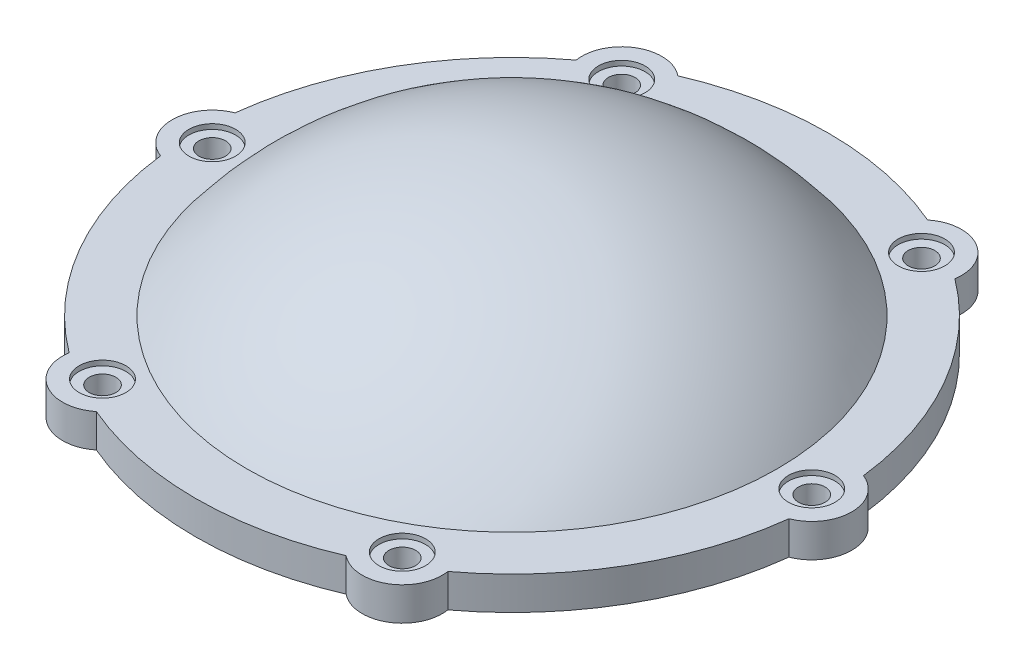
ISO-10303-21;
HEADER;
FILE_DESCRIPTION(('STEP AP214'),'2;1');
FILE_NAME('part.step','',(''),(''),'','','');
FILE_SCHEMA(('AUTOMOTIVE_DESIGN { 1 0 10303 214 1 1 1 1 }'));
ENDSEC;
DATA;
#1=APPLICATION_CONTEXT('core data for automotive mechanical design processes');
#2=APPLICATION_PROTOCOL_DEFINITION('international standard','automotive_design',2000,#1);
#3=PRODUCT_CONTEXT('',#1,'mechanical');
#4=PRODUCT('Part','Part','',(#3));
#5=PRODUCT_RELATED_PRODUCT_CATEGORY('part','',(#4));
#6=PRODUCT_DEFINITION_FORMATION('','',#4);
#7=PRODUCT_DEFINITION_CONTEXT('part definition',#1,'design');
#8=PRODUCT_DEFINITION('design','',#6,#7);
#9=PRODUCT_DEFINITION_SHAPE('','',#8);
#10=(LENGTH_UNIT() NAMED_UNIT(*) SI_UNIT(.MILLI.,.METRE.));
#11=(NAMED_UNIT(*) PLANE_ANGLE_UNIT() SI_UNIT($,.RADIAN.));
#12=(NAMED_UNIT(*) SI_UNIT($,.STERADIAN.) SOLID_ANGLE_UNIT());
#13=UNCERTAINTY_MEASURE_WITH_UNIT(LENGTH_MEASURE(1.E-05),#10,'distance_accuracy_value','');
#14=(GEOMETRIC_REPRESENTATION_CONTEXT(3) GLOBAL_UNCERTAINTY_ASSIGNED_CONTEXT((#13)) GLOBAL_UNIT_ASSIGNED_CONTEXT((#10,
#11,#12)) REPRESENTATION_CONTEXT('',''));
#15=CARTESIAN_POINT('',(0.,0.,0.));
#16=DIRECTION('',(0.,0.,1.));
#17=DIRECTION('',(1.,0.,0.));
#18=AXIS2_PLACEMENT_3D('',#15,#16,#17);
#19=CARTESIAN_POINT('',(0.,0.,0.));
#20=DIRECTION('',(0.,-1.,0.));
#21=DIRECTION('',(0.,0.,-1.));
#22=AXIS2_PLACEMENT_3D('',#19,#20,#21);
#23=CYLINDRICAL_SURFACE('',#22,47.5);
#24=DIRECTION('',(0.,1.,0.));
#25=VECTOR('',#24,1.);
#26=CARTESIAN_POINT('',(28.4293205648979,4.,-38.0529070140281));
#27=LINE('',#26,#25);
#28=CARTESIAN_POINT('',(28.4293205648979,6.5,-38.0529070140281));
#29=VERTEX_POINT('',#28);
#30=CARTESIAN_POINT('',(28.4293205648979,1.5,-38.0529070140281));
#31=VERTEX_POINT('',#30);
#32=EDGE_CURVE('E47',#29,#31,#27,.F.);
#33=ORIENTED_EDGE('',*,*,#32,.F.);
#34=CARTESIAN_POINT('',(0.,6.5,0.));
#35=DIRECTION('',(0.,-1.,0.));
#36=DIRECTION('',(0.,0.,-1.));
#37=AXIS2_PLACEMENT_3D('',#34,#35,#36);
#38=CIRCLE('',#37,47.5);
#39=CARTESIAN_POINT('',(47.1694444444444,6.5,-5.59406031451835));
#40=VERTEX_POINT('',#39);
#41=EDGE_CURVE('E130',#29,#40,#38,.T.);
#42=ORIENTED_EDGE('',*,*,#41,.T.);
#43=DIRECTION('',(0.,1.,0.));
#44=VECTOR('',#43,1.);
#45=CARTESIAN_POINT('',(47.1694444444444,4.,-5.59406031451835));
#46=LINE('',#45,#44);
#47=CARTESIAN_POINT('',(47.1694444444445,1.5,-5.59406031451836));
#48=VERTEX_POINT('',#47);
#49=EDGE_CURVE('E201',#48,#40,#46,.T.);
#50=ORIENTED_EDGE('',*,*,#49,.F.);
#51=CARTESIAN_POINT('',(0.,1.5,0.));
#52=DIRECTION('',(0.,-1.,0.));
#53=DIRECTION('',(0.,0.,-1.));
#54=AXIS2_PLACEMENT_3D('',#51,#52,#53);
#55=CIRCLE('',#54,47.5);
#56=EDGE_CURVE('E52',#31,#48,#55,.T.);
#57=ORIENTED_EDGE('',*,*,#56,.F.);
#58=EDGE_LOOP('',(#33,#42,#50,#57));
#59=FACE_BOUND('',#58,.T.);
#60=ADVANCED_FACE('F32',(#59),#23,.T.);
#61=DIRECTION('',(0.,1.,0.));
#62=VECTOR('',#61,1.);
#63=CARTESIAN_POINT('',(18.7401238795475,4.,-43.6469673285466));
#64=LINE('',#63,#62);
#65=CARTESIAN_POINT('',(18.7401238795475,1.5,-43.6469673285466));
#66=VERTEX_POINT('',#65);
#67=CARTESIAN_POINT('',(18.7401238795475,6.5,-43.6469673285466));
#68=VERTEX_POINT('',#67);
#69=EDGE_CURVE('E121',#66,#68,#64,.T.);
#70=ORIENTED_EDGE('',*,*,#69,.F.);
#71=CARTESIAN_POINT('',(-18.7401238795465,1.5,-43.646967328547));
#72=VERTEX_POINT('',#71);
#73=EDGE_CURVE('E240',#72,#66,#55,.T.);
#74=ORIENTED_EDGE('',*,*,#73,.F.);
#75=DIRECTION('',(0.,1.,0.));
#76=VECTOR('',#75,1.);
#77=CARTESIAN_POINT('',(-18.7401238795465,4.,-43.646967328547));
#78=LINE('',#77,#76);
#79=CARTESIAN_POINT('',(-18.7401238795465,6.5,-43.646967328547));
#80=VERTEX_POINT('',#79);
#81=EDGE_CURVE('E124',#80,#72,#78,.F.);
#82=ORIENTED_EDGE('',*,*,#81,.F.);
#83=EDGE_CURVE('E118',#80,#68,#38,.T.);
#84=ORIENTED_EDGE('',*,*,#83,.T.);
#85=EDGE_LOOP('',(#70,#74,#82,#84));
#86=FACE_BOUND('',#85,.T.);
#87=ADVANCED_FACE('F120',(#86),#23,.T.);
#88=DIRECTION('',(0.,1.,0.));
#89=VECTOR('',#88,1.);
#90=CARTESIAN_POINT('',(-28.4293205648971,4.,-38.0529070140287));
#91=LINE('',#90,#89);
#92=CARTESIAN_POINT('',(-28.4293205648971,1.5,-38.0529070140287));
#93=VERTEX_POINT('',#92);
#94=CARTESIAN_POINT('',(-28.4293205648971,6.5,-38.0529070140287));
#95=VERTEX_POINT('',#94);
#96=EDGE_CURVE('E156',#93,#95,#91,.T.);
#97=ORIENTED_EDGE('',*,*,#96,.F.);
#98=CARTESIAN_POINT('',(-47.1694444444444,1.5,-5.59406031451869));
#99=VERTEX_POINT('',#98);
#100=EDGE_CURVE('E241',#99,#93,#55,.T.);
#101=ORIENTED_EDGE('',*,*,#100,.F.);
#102=DIRECTION('',(0.,1.,0.));
#103=VECTOR('',#102,1.);
#104=CARTESIAN_POINT('',(-47.1694444444444,4.,-5.59406031451868));
#105=LINE('',#104,#103);
#106=CARTESIAN_POINT('',(-47.1694444444444,6.5,-5.59406031451869));
#107=VERTEX_POINT('',#106);
#108=EDGE_CURVE('E169',#107,#99,#105,.F.);
#109=ORIENTED_EDGE('',*,*,#108,.F.);
#110=EDGE_CURVE('E129',#107,#95,#38,.T.);
#111=ORIENTED_EDGE('',*,*,#110,.T.);
#112=EDGE_LOOP('',(#97,#101,#109,#111));
#113=FACE_BOUND('',#112,.T.);
#114=ADVANCED_FACE('F258',(#113),#23,.T.);
#115=DIRECTION('',(0.,1.,0.));
#116=VECTOR('',#115,1.);
#117=CARTESIAN_POINT('',(-47.1694444444445,4.,5.59406031451803));
#118=LINE('',#117,#116);
#119=CARTESIAN_POINT('',(-47.1694444444445,1.5,5.59406031451803));
#120=VERTEX_POINT('',#119);
#121=CARTESIAN_POINT('',(-47.1694444444445,6.5,5.59406031451803));
#122=VERTEX_POINT('',#121);
#123=EDGE_CURVE('E166',#120,#122,#118,.T.);
#124=ORIENTED_EDGE('',*,*,#123,.F.);
#125=CARTESIAN_POINT('',(-28.4293205648977,1.5,38.0529070140283));
#126=VERTEX_POINT('',#125);
#127=EDGE_CURVE('E244',#126,#120,#55,.T.);
#128=ORIENTED_EDGE('',*,*,#127,.F.);
#129=DIRECTION('',(0.,1.,0.));
#130=VECTOR('',#129,1.);
#131=CARTESIAN_POINT('',(-28.4293205648977,4.,38.0529070140283));
#132=LINE('',#131,#130);
#133=CARTESIAN_POINT('',(-28.4293205648977,6.5,38.0529070140283));
#134=VERTEX_POINT('',#133);
#135=EDGE_CURVE('E181',#134,#126,#132,.F.);
#136=ORIENTED_EDGE('',*,*,#135,.F.);
#137=EDGE_CURVE('E225',#134,#122,#38,.T.);
#138=ORIENTED_EDGE('',*,*,#137,.T.);
#139=EDGE_LOOP('',(#124,#128,#136,#138));
#140=FACE_BOUND('',#139,.T.);
#141=ADVANCED_FACE('F254',(#140),#23,.T.);
#142=DIRECTION('',(0.,1.,0.));
#143=VECTOR('',#142,1.);
#144=CARTESIAN_POINT('',(-18.7401238795472,4.,43.6469673285467));
#145=LINE('',#144,#143);
#146=CARTESIAN_POINT('',(-18.7401238795471,1.5,43.6469673285467));
#147=VERTEX_POINT('',#146);
#148=CARTESIAN_POINT('',(-18.7401238795471,6.5,43.6469673285467));
#149=VERTEX_POINT('',#148);
#150=EDGE_CURVE('E178',#147,#149,#145,.T.);
#151=ORIENTED_EDGE('',*,*,#150,.F.);
#152=CARTESIAN_POINT('',(18.7401238795469,1.5,43.6469673285469));
#153=VERTEX_POINT('',#152);
#154=EDGE_CURVE('E221',#153,#147,#55,.T.);
#155=ORIENTED_EDGE('',*,*,#154,.F.);
#156=DIRECTION('',(0.,1.,0.));
#157=VECTOR('',#156,1.);
#158=CARTESIAN_POINT('',(18.7401238795469,4.,43.6469673285469));
#159=LINE('',#158,#157);
#160=CARTESIAN_POINT('',(18.7401238795469,6.5,43.6469673285469));
#161=VERTEX_POINT('',#160);
#162=EDGE_CURVE('E193',#161,#153,#159,.F.);
#163=ORIENTED_EDGE('',*,*,#162,.F.);
#164=EDGE_CURVE('E222',#161,#149,#38,.T.);
#165=ORIENTED_EDGE('',*,*,#164,.T.);
#166=EDGE_LOOP('',(#151,#155,#163,#165));
#167=FACE_BOUND('',#166,.T.);
#168=ADVANCED_FACE('F279',(#167),#23,.T.);
#169=CARTESIAN_POINT('',(0.,-23.75,0.));
#170=DIRECTION('',(0.,-1.,0.));
#171=DIRECTION('',(1.,0.,0.));
#172=AXIS2_PLACEMENT_3D('',#169,#170,#171);
#173=SPHERICAL_SURFACE('',#172,50.);
#174=CARTESIAN_POINT('',(0.,6.5,0.));
#175=DIRECTION('',(0.,-1.,0.));
#176=DIRECTION('',(0.,0.,-1.));
#177=AXIS2_PLACEMENT_3D('',#174,#175,#176);
#178=CIRCLE('',#177,39.8112735289892);
#179=CARTESIAN_POINT('',(0.,6.5,-39.8112735289892));
#180=VERTEX_POINT('',#179);
#181=EDGE_CURVE('E11',#180,#180,#178,.T.);
#182=ORIENTED_EDGE('',*,*,#181,.F.);
#183=EDGE_LOOP('',(#182));
#184=FACE_BOUND('',#183,.T.);
#185=ADVANCED_FACE('F34',(#184),#173,.T.);
#186=CARTESIAN_POINT('',(39.8112735289892,6.5,0.));
#187=DIRECTION('',(0.,1.,0.));
#188=DIRECTION('',(0.,0.,1.));
#189=AXIS2_PLACEMENT_3D('',#186,#187,#188);
#190=PLANE('',#189);
#191=CARTESIAN_POINT('',(22.5000000000003,6.5,-38.9711431702996));
#192=DIRECTION('',(0.,1.,0.));
#193=DIRECTION('',(0.866025403784435,0.,0.500000000000007));
#194=AXIS2_PLACEMENT_3D('',#191,#192,#193);
#195=CIRCLE('',#194,3.5);
#196=CARTESIAN_POINT('',(25.5310889132458,6.5,-37.2211431702995));
#197=VERTEX_POINT('',#196);
#198=EDGE_CURVE('E604',#197,#197,#195,.T.);
#199=ORIENTED_EDGE('',*,*,#198,.F.);
#200=EDGE_LOOP('',(#199));
#201=FACE_BOUND('',#200,.T.);
#202=CARTESIAN_POINT('',(-22.4999999999997,6.5,-38.9711431702999));
#203=DIRECTION('',(0.,1.,0.));
#204=DIRECTION('',(0.866025403784442,0.,-0.499999999999994));
#205=AXIS2_PLACEMENT_3D('',#202,#203,#204);
#206=CIRCLE('',#205,3.5);
#207=CARTESIAN_POINT('',(-19.4689110867542,6.5,-40.7211431702999));
#208=VERTEX_POINT('',#207);
#209=EDGE_CURVE('E592',#208,#208,#206,.T.);
#210=ORIENTED_EDGE('',*,*,#209,.F.);
#211=EDGE_LOOP('',(#210));
#212=FACE_BOUND('',#211,.T.);
#213=CARTESIAN_POINT('',(-45.,6.5,-2.34297262722871E-13));
#214=DIRECTION('',(0.,1.,0.));
#215=DIRECTION('',(0.,0.,-1.));
#216=AXIS2_PLACEMENT_3D('',#213,#214,#215);
#217=CIRCLE('',#216,3.5);
#218=CARTESIAN_POINT('',(-45.,6.5,-3.50000000000024));
#219=VERTEX_POINT('',#218);
#220=EDGE_CURVE('E580',#219,#219,#217,.T.);
#221=ORIENTED_EDGE('',*,*,#220,.F.);
#222=EDGE_LOOP('',(#221));
#223=FACE_BOUND('',#222,.T.);
#224=CARTESIAN_POINT('',(-22.5000000000001,6.5,38.9711431702997));
#225=DIRECTION('',(0.,1.,0.));
#226=DIRECTION('',(-0.866025403784437,0.,-0.500000000000003));
#227=AXIS2_PLACEMENT_3D('',#224,#225,#226);
#228=CIRCLE('',#227,3.5);
#229=CARTESIAN_POINT('',(-25.5310889132457,6.5,37.2211431702997));
#230=VERTEX_POINT('',#229);
#231=EDGE_CURVE('E568',#230,#230,#228,.T.);
#232=ORIENTED_EDGE('',*,*,#231,.F.);
#233=EDGE_LOOP('',(#232));
#234=FACE_BOUND('',#233,.T.);
#235=CARTESIAN_POINT('',(22.4999999999999,6.5,38.9711431702998));
#236=DIRECTION('',(0.,1.,0.));
#237=DIRECTION('',(-0.866025403784439,0.,0.499999999999999));
#238=AXIS2_PLACEMENT_3D('',#235,#236,#237);
#239=CIRCLE('',#238,3.5);
#240=CARTESIAN_POINT('',(19.4689110867544,6.5,40.7211431702998));
#241=VERTEX_POINT('',#240);
#242=EDGE_CURVE('E556',#241,#241,#239,.T.);
#243=ORIENTED_EDGE('',*,*,#242,.F.);
#244=EDGE_LOOP('',(#243));
#245=FACE_BOUND('',#244,.T.);
#246=CARTESIAN_POINT('',(45.,6.5,0.));
#247=DIRECTION('',(0.,1.,0.));
#248=DIRECTION('',(0.,0.,1.));
#249=AXIS2_PLACEMENT_3D('',#246,#247,#248);
#250=CIRCLE('',#249,3.5);
#251=CARTESIAN_POINT('',(45.,6.5,3.5));
#252=VERTEX_POINT('',#251);
#253=EDGE_CURVE('E142',#252,#252,#250,.T.);
#254=ORIENTED_EDGE('',*,*,#253,.F.);
#255=EDGE_LOOP('',(#254));
#256=FACE_BOUND('',#255,.T.);
#257=ORIENTED_EDGE('',*,*,#41,.F.);
#258=CARTESIAN_POINT('',(22.5000000000005,6.5,-38.9711431702995));
#259=DIRECTION('',(0.,1.,0.));
#260=DIRECTION('',(0.,0.,-1.));
#261=AXIS2_PLACEMENT_3D('',#258,#259,#260);
#262=CIRCLE('',#261,6.);
#263=EDGE_CURVE('E135',#29,#68,#262,.T.);
#264=ORIENTED_EDGE('',*,*,#263,.T.);
#265=ORIENTED_EDGE('',*,*,#83,.F.);
#266=CARTESIAN_POINT('',(-22.4999999999996,6.5,-38.9711431702999));
#267=DIRECTION('',(0.,1.,0.));
#268=DIRECTION('',(0.,0.,-1.));
#269=AXIS2_PLACEMENT_3D('',#266,#267,#268);
#270=CIRCLE('',#269,6.);
#271=EDGE_CURVE('E151',#80,#95,#270,.T.);
#272=ORIENTED_EDGE('',*,*,#271,.T.);
#273=ORIENTED_EDGE('',*,*,#110,.F.);
#274=CARTESIAN_POINT('',(-45.,6.5,-3.14233320495882E-13));
#275=DIRECTION('',(0.,1.,0.));
#276=DIRECTION('',(0.,0.,-1.));
#277=AXIS2_PLACEMENT_3D('',#274,#275,#276);
#278=CIRCLE('',#277,6.);
#279=EDGE_CURVE('E160',#107,#122,#278,.T.);
#280=ORIENTED_EDGE('',*,*,#279,.T.);
#281=ORIENTED_EDGE('',*,*,#137,.F.);
#282=CARTESIAN_POINT('',(-22.5000000000002,6.5,38.9711431702996));
#283=DIRECTION('',(0.,1.,0.));
#284=DIRECTION('',(0.,0.,-1.));
#285=AXIS2_PLACEMENT_3D('',#282,#283,#284);
#286=CIRCLE('',#285,6.00000000000001);
#287=EDGE_CURVE('E172',#134,#149,#286,.T.);
#288=ORIENTED_EDGE('',*,*,#287,.T.);
#289=ORIENTED_EDGE('',*,*,#164,.F.);
#290=CARTESIAN_POINT('',(22.4999999999999,6.5,38.9711431702998));
#291=DIRECTION('',(0.,1.,0.));
#292=DIRECTION('',(0.,0.,-1.));
#293=AXIS2_PLACEMENT_3D('',#290,#291,#292);
#294=CIRCLE('',#293,6.00000000000001);
#295=CARTESIAN_POINT('',(28.4293205648974,6.5,38.0529070140285));
#296=VERTEX_POINT('',#295);
#297=EDGE_CURVE('E184',#161,#296,#294,.T.);
#298=ORIENTED_EDGE('',*,*,#297,.T.);
#299=CARTESIAN_POINT('',(47.1694444444444,6.5,5.59406031451835));
#300=VERTEX_POINT('',#299);
#301=EDGE_CURVE('E40',#300,#296,#38,.T.);
#302=ORIENTED_EDGE('',*,*,#301,.F.);
#303=CARTESIAN_POINT('',(45.,6.5,0.));
#304=DIRECTION('',(0.,1.,0.));
#305=DIRECTION('',(0.,0.,-1.));
#306=AXIS2_PLACEMENT_3D('',#303,#304,#305);
#307=CIRCLE('',#306,6.);
#308=EDGE_CURVE('E196',#300,#40,#307,.T.);
#309=ORIENTED_EDGE('',*,*,#308,.T.);
#310=EDGE_LOOP('',(#257,#264,#265,#272,#273,#280,#281,#288,#289,#298,#302,#309));
#311=FACE_BOUND('',#310,.T.);
#312=ORIENTED_EDGE('',*,*,#181,.T.);
#313=EDGE_LOOP('',(#312));
#314=FACE_BOUND('',#313,.T.);
#315=ADVANCED_FACE('F139',(#201,#212,#223,#234,#245,#256,#311,#314),#190,.T.);
#316=DIRECTION('',(0.,1.,0.));
#317=VECTOR('',#316,1.);
#318=CARTESIAN_POINT('',(28.4293205648974,4.,38.0529070140285));
#319=LINE('',#318,#317);
#320=CARTESIAN_POINT('',(28.4293205648974,1.5,38.0529070140285));
#321=VERTEX_POINT('',#320);
#322=EDGE_CURVE('E190',#321,#296,#319,.T.);
#323=ORIENTED_EDGE('',*,*,#322,.F.);
#324=CARTESIAN_POINT('',(47.1694444444445,1.5,5.59406031451836));
#325=VERTEX_POINT('',#324);
#326=EDGE_CURVE('E219',#325,#321,#55,.T.);
#327=ORIENTED_EDGE('',*,*,#326,.F.);
#328=DIRECTION('',(0.,1.,0.));
#329=VECTOR('',#328,1.);
#330=CARTESIAN_POINT('',(47.1694444444444,4.,5.59406031451835));
#331=LINE('',#330,#329);
#332=EDGE_CURVE('E204',#300,#325,#331,.F.);
#333=ORIENTED_EDGE('',*,*,#332,.F.);
#334=ORIENTED_EDGE('',*,*,#301,.T.);
#335=EDGE_LOOP('',(#323,#327,#333,#334));
#336=FACE_BOUND('',#335,.T.);
#337=ADVANCED_FACE('F235',(#336),#23,.T.);
#338=CARTESIAN_POINT('',(42.,1.5,0.));
#339=DIRECTION('',(0.,-1.,0.));
#340=DIRECTION('',(0.,0.,-1.));
#341=AXIS2_PLACEMENT_3D('',#338,#339,#340);
#342=PLANE('',#341);
#343=CARTESIAN_POINT('',(22.5000000000003,1.5,-38.9711431702996));
#344=DIRECTION('',(0.,1.,0.));
#345=DIRECTION('',(0.866025403784435,0.,0.500000000000007));
#346=AXIS2_PLACEMENT_3D('',#343,#344,#345);
#347=CIRCLE('',#346,2.);
#348=CARTESIAN_POINT('',(24.2320508075692,1.5,-37.9711431702995));
#349=VERTEX_POINT('',#348);
#350=EDGE_CURVE('E612',#349,#349,#347,.T.);
#351=ORIENTED_EDGE('',*,*,#350,.T.);
#352=EDGE_LOOP('',(#351));
#353=FACE_BOUND('',#352,.T.);
#354=CARTESIAN_POINT('',(-22.4999999999997,1.5,-38.9711431702999));
#355=DIRECTION('',(0.,1.,0.));
#356=DIRECTION('',(0.866025403784442,0.,-0.499999999999994));
#357=AXIS2_PLACEMENT_3D('',#354,#355,#356);
#358=CIRCLE('',#357,2.);
#359=CARTESIAN_POINT('',(-20.7679491924309,1.5,-39.9711431702999));
#360=VERTEX_POINT('',#359);
#361=EDGE_CURVE('E601',#360,#360,#358,.T.);
#362=ORIENTED_EDGE('',*,*,#361,.T.);
#363=EDGE_LOOP('',(#362));
#364=FACE_BOUND('',#363,.T.);
#365=CARTESIAN_POINT('',(-45.,1.5,-2.34297262722871E-13));
#366=DIRECTION('',(0.,1.,0.));
#367=DIRECTION('',(0.,0.,-1.));
#368=AXIS2_PLACEMENT_3D('',#365,#366,#367);
#369=CIRCLE('',#368,2.);
#370=CARTESIAN_POINT('',(-45.,1.5,-2.00000000000024));
#371=VERTEX_POINT('',#370);
#372=EDGE_CURVE('E589',#371,#371,#369,.T.);
#373=ORIENTED_EDGE('',*,*,#372,.T.);
#374=EDGE_LOOP('',(#373));
#375=FACE_BOUND('',#374,.T.);
#376=CARTESIAN_POINT('',(-22.5000000000001,1.5,38.9711431702997));
#377=DIRECTION('',(0.,1.,0.));
#378=DIRECTION('',(-0.866025403784437,0.,-0.500000000000003));
#379=AXIS2_PLACEMENT_3D('',#376,#377,#378);
#380=CIRCLE('',#379,2.);
#381=CARTESIAN_POINT('',(-24.232050807569,1.5,37.9711431702997));
#382=VERTEX_POINT('',#381);
#383=EDGE_CURVE('E577',#382,#382,#380,.T.);
#384=ORIENTED_EDGE('',*,*,#383,.T.);
#385=EDGE_LOOP('',(#384));
#386=FACE_BOUND('',#385,.T.);
#387=CARTESIAN_POINT('',(22.4999999999999,1.5,38.9711431702998));
#388=DIRECTION('',(0.,1.,0.));
#389=DIRECTION('',(-0.866025403784439,0.,0.499999999999999));
#390=AXIS2_PLACEMENT_3D('',#387,#388,#389);
#391=CIRCLE('',#390,2.);
#392=CARTESIAN_POINT('',(20.7679491924311,1.5,39.9711431702998));
#393=VERTEX_POINT('',#392);
#394=EDGE_CURVE('E565',#393,#393,#391,.T.);
#395=ORIENTED_EDGE('',*,*,#394,.T.);
#396=EDGE_LOOP('',(#395));
#397=FACE_BOUND('',#396,.T.);
#398=CARTESIAN_POINT('',(45.,1.5,0.));
#399=DIRECTION('',(0.,1.,0.));
#400=DIRECTION('',(0.,0.,1.));
#401=AXIS2_PLACEMENT_3D('',#398,#399,#400);
#402=CIRCLE('',#401,2.);
#403=CARTESIAN_POINT('',(45.,1.5,2.));
#404=VERTEX_POINT('',#403);
#405=EDGE_CURVE('E551',#404,#404,#402,.T.);
#406=ORIENTED_EDGE('',*,*,#405,.T.);
#407=EDGE_LOOP('',(#406));
#408=FACE_BOUND('',#407,.T.);
#409=ORIENTED_EDGE('',*,*,#73,.T.);
#410=CARTESIAN_POINT('',(22.5000000000005,1.5,-38.9711431702995));
#411=DIRECTION('',(0.,-1.,0.));
#412=DIRECTION('',(0.,0.,-1.));
#413=AXIS2_PLACEMENT_3D('',#410,#411,#412);
#414=CIRCLE('',#413,6.);
#415=EDGE_CURVE('E137',#31,#66,#414,.F.);
#416=ORIENTED_EDGE('',*,*,#415,.F.);
#417=ORIENTED_EDGE('',*,*,#56,.T.);
#418=CARTESIAN_POINT('',(45.,1.5,0.));
#419=DIRECTION('',(0.,-1.,0.));
#420=DIRECTION('',(0.,0.,-1.));
#421=AXIS2_PLACEMENT_3D('',#418,#419,#420);
#422=CIRCLE('',#421,6.);
#423=EDGE_CURVE('E198',#325,#48,#422,.F.);
#424=ORIENTED_EDGE('',*,*,#423,.F.);
#425=ORIENTED_EDGE('',*,*,#326,.T.);
#426=CARTESIAN_POINT('',(22.4999999999999,1.5,38.9711431702998));
#427=DIRECTION('',(0.,-1.,0.));
#428=DIRECTION('',(0.,0.,-1.));
#429=AXIS2_PLACEMENT_3D('',#426,#427,#428);
#430=CIRCLE('',#429,6.00000000000001);
#431=EDGE_CURVE('E187',#153,#321,#430,.F.);
#432=ORIENTED_EDGE('',*,*,#431,.F.);
#433=ORIENTED_EDGE('',*,*,#154,.T.);
#434=CARTESIAN_POINT('',(-22.5000000000002,1.5,38.9711431702996));
#435=DIRECTION('',(0.,-1.,0.));
#436=DIRECTION('',(0.,0.,-1.));
#437=AXIS2_PLACEMENT_3D('',#434,#435,#436);
#438=CIRCLE('',#437,6.00000000000001);
#439=EDGE_CURVE('E175',#126,#147,#438,.F.);
#440=ORIENTED_EDGE('',*,*,#439,.F.);
#441=ORIENTED_EDGE('',*,*,#127,.T.);
#442=CARTESIAN_POINT('',(-45.,1.5,-3.14233320495882E-13));
#443=DIRECTION('',(0.,-1.,0.));
#444=DIRECTION('',(0.,0.,-1.));
#445=AXIS2_PLACEMENT_3D('',#442,#443,#444);
#446=CIRCLE('',#445,6.);
#447=EDGE_CURVE('E163',#99,#120,#446,.F.);
#448=ORIENTED_EDGE('',*,*,#447,.F.);
#449=ORIENTED_EDGE('',*,*,#100,.T.);
#450=CARTESIAN_POINT('',(-22.4999999999996,1.5,-38.9711431702999));
#451=DIRECTION('',(0.,-1.,0.));
#452=DIRECTION('',(0.,0.,-1.));
#453=AXIS2_PLACEMENT_3D('',#450,#451,#452);
#454=CIRCLE('',#453,6.);
#455=EDGE_CURVE('E153',#72,#93,#454,.F.);
#456=ORIENTED_EDGE('',*,*,#455,.F.);
#457=EDGE_LOOP('',(#409,#416,#417,#424,#425,#432,#433,#440,#441,#448,#449,#456));
#458=FACE_BOUND('',#457,.T.);
#459=CARTESIAN_POINT('',(0.,1.5,0.));
#460=DIRECTION('',(0.,-1.,0.));
#461=DIRECTION('',(0.,0.,-1.));
#462=AXIS2_PLACEMENT_3D('',#459,#460,#461);
#463=CIRCLE('',#462,42.);
#464=CARTESIAN_POINT('',(0.,1.5,-42.));
#465=VERTEX_POINT('',#464);
#466=EDGE_CURVE('E216',#465,#465,#463,.T.);
#467=ORIENTED_EDGE('',*,*,#466,.F.);
#468=EDGE_LOOP('',(#467));
#469=FACE_BOUND('',#468,.T.);
#470=ADVANCED_FACE('F237',(#353,#364,#375,#386,#397,#408,#458,#469),#342,.T.);
#471=CARTESIAN_POINT('',(0.,0.,0.));
#472=DIRECTION('',(0.,-1.,0.));
#473=DIRECTION('',(0.,0.,-1.));
#474=AXIS2_PLACEMENT_3D('',#471,#472,#473);
#475=CYLINDRICAL_SURFACE('',#474,42.);
#476=ORIENTED_EDGE('',*,*,#466,.T.);
#477=EDGE_LOOP('',(#476));
#478=FACE_BOUND('',#477,.T.);
#479=CARTESIAN_POINT('',(0.,0.,0.));
#480=DIRECTION('',(0.,-1.,0.));
#481=DIRECTION('',(0.,0.,-1.));
#482=AXIS2_PLACEMENT_3D('',#479,#480,#481);
#483=CIRCLE('',#482,42.);
#484=CARTESIAN_POINT('',(0.,0.,-42.));
#485=VERTEX_POINT('',#484);
#486=EDGE_CURVE('E213',#485,#485,#483,.T.);
#487=ORIENTED_EDGE('',*,*,#486,.F.);
#488=EDGE_LOOP('',(#487));
#489=FACE_BOUND('',#488,.T.);
#490=ADVANCED_FACE('F284',(#478,#489),#475,.T.);
#491=CARTESIAN_POINT('',(40.,0.,0.));
#492=DIRECTION('',(0.,-1.,0.));
#493=DIRECTION('',(0.,0.,-1.));
#494=AXIS2_PLACEMENT_3D('',#491,#492,#493);
#495=PLANE('',#494);
#496=ORIENTED_EDGE('',*,*,#486,.T.);
#497=EDGE_LOOP('',(#496));
#498=FACE_BOUND('',#497,.T.);
#499=CARTESIAN_POINT('',(0.,0.,0.));
#500=DIRECTION('',(0.,-1.,0.));
#501=DIRECTION('',(0.,0.,-1.));
#502=AXIS2_PLACEMENT_3D('',#499,#500,#501);
#503=CIRCLE('',#502,40.);
#504=CARTESIAN_POINT('',(0.,0.,-40.));
#505=VERTEX_POINT('',#504);
#506=EDGE_CURVE('E210',#505,#505,#503,.T.);
#507=ORIENTED_EDGE('',*,*,#506,.F.);
#508=EDGE_LOOP('',(#507));
#509=FACE_BOUND('',#508,.T.);
#510=ADVANCED_FACE('F329',(#498,#509),#495,.T.);
#511=CARTESIAN_POINT('',(0.,0.,0.));
#512=DIRECTION('',(0.,-1.,0.));
#513=DIRECTION('',(0.,0.,-1.));
#514=AXIS2_PLACEMENT_3D('',#511,#512,#513);
#515=CYLINDRICAL_SURFACE('',#514,40.);
#516=ORIENTED_EDGE('',*,*,#506,.T.);
#517=EDGE_LOOP('',(#516));
#518=FACE_BOUND('',#517,.T.);
#519=CARTESIAN_POINT('',(0.,0.927925358506142,0.));
#520=DIRECTION('',(0.,-1.,0.));
#521=DIRECTION('',(0.,0.,-1.));
#522=AXIS2_PLACEMENT_3D('',#519,#520,#521);
#523=CIRCLE('',#522,40.);
#524=CARTESIAN_POINT('',(0.,0.927925358506142,-40.));
#525=VERTEX_POINT('',#524);
#526=EDGE_CURVE('E207',#525,#525,#523,.T.);
#527=ORIENTED_EDGE('',*,*,#526,.F.);
#528=EDGE_LOOP('',(#527));
#529=FACE_BOUND('',#528,.T.);
#530=ADVANCED_FACE('F317',(#518,#529),#515,.F.);
#531=CARTESIAN_POINT('',(0.,-23.75,0.));
#532=DIRECTION('',(0.,-1.,0.));
#533=DIRECTION('',(-1.,0.,0.));
#534=AXIS2_PLACEMENT_3D('',#531,#532,#533);
#535=SPHERICAL_SURFACE('',#534,47.);
#536=ORIENTED_EDGE('',*,*,#526,.T.);
#537=EDGE_LOOP('',(#536));
#538=FACE_BOUND('',#537,.T.);
#539=ADVANCED_FACE('F312',(#538),#535,.F.);
#540=CARTESIAN_POINT('',(45.,-13.225475123163,0.));
#541=DIRECTION('',(0.,1.,0.));
#542=DIRECTION('',(0.,0.,1.));
#543=AXIS2_PLACEMENT_3D('',#540,#541,#542);
#544=CYLINDRICAL_SURFACE('',#543,6.);
#545=ORIENTED_EDGE('',*,*,#308,.F.);
#546=ORIENTED_EDGE('',*,*,#332,.T.);
#547=ORIENTED_EDGE('',*,*,#423,.T.);
#548=ORIENTED_EDGE('',*,*,#49,.T.);
#549=EDGE_LOOP('',(#545,#546,#547,#548));
#550=FACE_BOUND('',#549,.T.);
#551=ADVANCED_FACE('F228',(#550),#544,.T.);
#552=CARTESIAN_POINT('',(22.4999999999999,-13.225475123163,38.9711431702998));
#553=DIRECTION('',(0.,1.,0.));
#554=DIRECTION('',(0.,0.,1.));
#555=AXIS2_PLACEMENT_3D('',#552,#553,#554);
#556=CYLINDRICAL_SURFACE('',#555,6.00000000000001);
#557=ORIENTED_EDGE('',*,*,#297,.F.);
#558=ORIENTED_EDGE('',*,*,#162,.T.);
#559=ORIENTED_EDGE('',*,*,#431,.T.);
#560=ORIENTED_EDGE('',*,*,#322,.T.);
#561=EDGE_LOOP('',(#557,#558,#559,#560));
#562=FACE_BOUND('',#561,.T.);
#563=ADVANCED_FACE('F233',(#562),#556,.T.);
#564=CARTESIAN_POINT('',(-22.5000000000002,-13.225475123163,38.9711431702996));
#565=DIRECTION('',(0.,1.,0.));
#566=DIRECTION('',(0.,0.,1.));
#567=AXIS2_PLACEMENT_3D('',#564,#565,#566);
#568=CYLINDRICAL_SURFACE('',#567,6.00000000000001);
#569=ORIENTED_EDGE('',*,*,#287,.F.);
#570=ORIENTED_EDGE('',*,*,#135,.T.);
#571=ORIENTED_EDGE('',*,*,#439,.T.);
#572=ORIENTED_EDGE('',*,*,#150,.T.);
#573=EDGE_LOOP('',(#569,#570,#571,#572));
#574=FACE_BOUND('',#573,.T.);
#575=ADVANCED_FACE('F251',(#574),#568,.T.);
#576=CARTESIAN_POINT('',(-45.,-13.225475123163,-3.14233320495882E-13));
#577=DIRECTION('',(0.,1.,0.));
#578=DIRECTION('',(0.,0.,1.));
#579=AXIS2_PLACEMENT_3D('',#576,#577,#578);
#580=CYLINDRICAL_SURFACE('',#579,6.);
#581=ORIENTED_EDGE('',*,*,#279,.F.);
#582=ORIENTED_EDGE('',*,*,#108,.T.);
#583=ORIENTED_EDGE('',*,*,#447,.T.);
#584=ORIENTED_EDGE('',*,*,#123,.T.);
#585=EDGE_LOOP('',(#581,#582,#583,#584));
#586=FACE_BOUND('',#585,.T.);
#587=ADVANCED_FACE('F262',(#586),#580,.T.);
#588=CARTESIAN_POINT('',(-22.4999999999996,-13.225475123163,-38.9711431702999));
#589=DIRECTION('',(0.,1.,0.));
#590=DIRECTION('',(0.,0.,1.));
#591=AXIS2_PLACEMENT_3D('',#588,#589,#590);
#592=CYLINDRICAL_SURFACE('',#591,6.);
#593=ORIENTED_EDGE('',*,*,#271,.F.);
#594=ORIENTED_EDGE('',*,*,#81,.T.);
#595=ORIENTED_EDGE('',*,*,#455,.T.);
#596=ORIENTED_EDGE('',*,*,#96,.T.);
#597=EDGE_LOOP('',(#593,#594,#595,#596));
#598=FACE_BOUND('',#597,.T.);
#599=ADVANCED_FACE('F260',(#598),#592,.T.);
#600=CARTESIAN_POINT('',(22.5000000000005,-13.225475123163,-38.9711431702995));
#601=DIRECTION('',(0.,1.,0.));
#602=DIRECTION('',(0.,0.,1.));
#603=AXIS2_PLACEMENT_3D('',#600,#601,#602);
#604=CYLINDRICAL_SURFACE('',#603,6.);
#605=ORIENTED_EDGE('',*,*,#263,.F.);
#606=ORIENTED_EDGE('',*,*,#32,.T.);
#607=ORIENTED_EDGE('',*,*,#415,.T.);
#608=ORIENTED_EDGE('',*,*,#69,.T.);
#609=EDGE_LOOP('',(#605,#606,#607,#608));
#610=FACE_BOUND('',#609,.T.);
#611=ADVANCED_FACE('F134',(#610),#604,.T.);
#612=CARTESIAN_POINT('',(45.,6.5,0.));
#613=DIRECTION('',(0.,1.,0.));
#614=DIRECTION('',(0.,0.,1.));
#615=AXIS2_PLACEMENT_3D('',#612,#613,#614);
#616=CYLINDRICAL_SURFACE('',#615,3.5);
#617=ORIENTED_EDGE('',*,*,#253,.T.);
#618=EDGE_LOOP('',(#617));
#619=FACE_BOUND('',#618,.T.);
#620=CARTESIAN_POINT('',(45.,5.75,0.));
#621=DIRECTION('',(0.,1.,0.));
#622=DIRECTION('',(0.,0.,1.));
#623=AXIS2_PLACEMENT_3D('',#620,#621,#622);
#624=CIRCLE('',#623,3.5);
#625=CARTESIAN_POINT('',(45.,5.75,3.5));
#626=VERTEX_POINT('',#625);
#627=EDGE_CURVE('E146',#626,#626,#624,.T.);
#628=ORIENTED_EDGE('',*,*,#627,.F.);
#629=EDGE_LOOP('',(#628));
#630=FACE_BOUND('',#629,.T.);
#631=ADVANCED_FACE('F268',(#619,#630),#616,.F.);
#632=CARTESIAN_POINT('',(48.5,5.75,0.));
#633=DIRECTION('',(0.,1.,0.));
#634=DIRECTION('',(0.,0.,1.));
#635=AXIS2_PLACEMENT_3D('',#632,#633,#634);
#636=PLANE('',#635);
#637=ORIENTED_EDGE('',*,*,#627,.T.);
#638=EDGE_LOOP('',(#637));
#639=FACE_BOUND('',#638,.T.);
#640=CARTESIAN_POINT('',(45.,5.75,0.));
#641=DIRECTION('',(0.,1.,0.));
#642=DIRECTION('',(0.,0.,1.));
#643=AXIS2_PLACEMENT_3D('',#640,#641,#642);
#644=CIRCLE('',#643,2.);
#645=CARTESIAN_POINT('',(45.,5.75,2.));
#646=VERTEX_POINT('',#645);
#647=EDGE_CURVE('E549',#646,#646,#644,.T.);
#648=ORIENTED_EDGE('',*,*,#647,.F.);
#649=EDGE_LOOP('',(#648));
#650=FACE_BOUND('',#649,.T.);
#651=ADVANCED_FACE('F536',(#639,#650),#636,.T.);
#652=CARTESIAN_POINT('',(45.,6.5,0.));
#653=DIRECTION('',(0.,1.,0.));
#654=DIRECTION('',(0.,0.,1.));
#655=AXIS2_PLACEMENT_3D('',#652,#653,#654);
#656=CYLINDRICAL_SURFACE('',#655,2.);
#657=ORIENTED_EDGE('',*,*,#647,.T.);
#658=EDGE_LOOP('',(#657));
#659=FACE_BOUND('',#658,.T.);
#660=ORIENTED_EDGE('',*,*,#405,.F.);
#661=EDGE_LOOP('',(#660));
#662=FACE_BOUND('',#661,.T.);
#663=ADVANCED_FACE('F370',(#659,#662),#656,.F.);
#664=CARTESIAN_POINT('',(22.4999999999999,6.5,38.9711431702998));
#665=DIRECTION('',(0.,1.,0.));
#666=DIRECTION('',(-0.866025403784439,0.,0.499999999999999));
#667=AXIS2_PLACEMENT_3D('',#664,#665,#666);
#668=CYLINDRICAL_SURFACE('',#667,3.5);
#669=ORIENTED_EDGE('',*,*,#242,.T.);
#670=EDGE_LOOP('',(#669));
#671=FACE_BOUND('',#670,.T.);
#672=CARTESIAN_POINT('',(22.4999999999999,5.75,38.9711431702998));
#673=DIRECTION('',(0.,1.,0.));
#674=DIRECTION('',(-0.866025403784439,0.,0.499999999999999));
#675=AXIS2_PLACEMENT_3D('',#672,#673,#674);
#676=CIRCLE('',#675,3.5);
#677=CARTESIAN_POINT('',(19.4689110867544,5.75,40.7211431702998));
#678=VERTEX_POINT('',#677);
#679=EDGE_CURVE('E559',#678,#678,#676,.T.);
#680=ORIENTED_EDGE('',*,*,#679,.F.);
#681=EDGE_LOOP('',(#680));
#682=FACE_BOUND('',#681,.T.);
#683=ADVANCED_FACE('F383',(#671,#682),#668,.F.);
#684=CARTESIAN_POINT('',(24.2499999999999,5.75,42.0022320835453));
#685=DIRECTION('',(0.,1.,0.));
#686=DIRECTION('',(-0.866025403784439,0.,0.499999999999999));
#687=AXIS2_PLACEMENT_3D('',#684,#685,#686);
#688=PLANE('',#687);
#689=ORIENTED_EDGE('',*,*,#679,.T.);
#690=EDGE_LOOP('',(#689));
#691=FACE_BOUND('',#690,.T.);
#692=CARTESIAN_POINT('',(22.4999999999999,5.75,38.9711431702998));
#693=DIRECTION('',(0.,1.,0.));
#694=DIRECTION('',(-0.866025403784439,0.,0.499999999999999));
#695=AXIS2_PLACEMENT_3D('',#692,#693,#694);
#696=CIRCLE('',#695,2.);
#697=CARTESIAN_POINT('',(20.7679491924311,5.75,39.9711431702998));
#698=VERTEX_POINT('',#697);
#699=EDGE_CURVE('E562',#698,#698,#696,.T.);
#700=ORIENTED_EDGE('',*,*,#699,.F.);
#701=EDGE_LOOP('',(#700));
#702=FACE_BOUND('',#701,.T.);
#703=ADVANCED_FACE('F388',(#691,#702),#688,.T.);
#704=CARTESIAN_POINT('',(22.4999999999999,6.5,38.9711431702998));
#705=DIRECTION('',(0.,1.,0.));
#706=DIRECTION('',(-0.866025403784439,0.,0.499999999999999));
#707=AXIS2_PLACEMENT_3D('',#704,#705,#706);
#708=CYLINDRICAL_SURFACE('',#707,2.);
#709=ORIENTED_EDGE('',*,*,#699,.T.);
#710=EDGE_LOOP('',(#709));
#711=FACE_BOUND('',#710,.T.);
#712=ORIENTED_EDGE('',*,*,#394,.F.);
#713=EDGE_LOOP('',(#712));
#714=FACE_BOUND('',#713,.T.);
#715=ADVANCED_FACE('F398',(#711,#714),#708,.F.);
#716=CARTESIAN_POINT('',(-22.5000000000001,6.5,38.9711431702997));
#717=DIRECTION('',(0.,1.,0.));
#718=DIRECTION('',(-0.866025403784437,0.,-0.500000000000003));
#719=AXIS2_PLACEMENT_3D('',#716,#717,#718);
#720=CYLINDRICAL_SURFACE('',#719,3.5);
#721=ORIENTED_EDGE('',*,*,#231,.T.);
#722=EDGE_LOOP('',(#721));
#723=FACE_BOUND('',#722,.T.);
#724=CARTESIAN_POINT('',(-22.5000000000001,5.75,38.9711431702997));
#725=DIRECTION('',(0.,1.,0.));
#726=DIRECTION('',(-0.866025403784437,0.,-0.500000000000003));
#727=AXIS2_PLACEMENT_3D('',#724,#725,#726);
#728=CIRCLE('',#727,3.5);
#729=CARTESIAN_POINT('',(-25.5310889132457,5.75,37.2211431702997));
#730=VERTEX_POINT('',#729);
#731=EDGE_CURVE('E571',#730,#730,#728,.T.);
#732=ORIENTED_EDGE('',*,*,#731,.F.);
#733=EDGE_LOOP('',(#732));
#734=FACE_BOUND('',#733,.T.);
#735=ADVANCED_FACE('F408',(#723,#734),#720,.F.);
#736=CARTESIAN_POINT('',(-24.2500000000001,5.75,42.0022320835452));
#737=DIRECTION('',(0.,1.,0.));
#738=DIRECTION('',(-0.866025403784437,0.,-0.500000000000003));
#739=AXIS2_PLACEMENT_3D('',#736,#737,#738);
#740=PLANE('',#739);
#741=ORIENTED_EDGE('',*,*,#731,.T.);
#742=EDGE_LOOP('',(#741));
#743=FACE_BOUND('',#742,.T.);
#744=CARTESIAN_POINT('',(-22.5000000000001,5.75,38.9711431702997));
#745=DIRECTION('',(0.,1.,0.));
#746=DIRECTION('',(-0.866025403784437,0.,-0.500000000000003));
#747=AXIS2_PLACEMENT_3D('',#744,#745,#746);
#748=CIRCLE('',#747,2.);
#749=CARTESIAN_POINT('',(-24.232050807569,5.75,37.9711431702997));
#750=VERTEX_POINT('',#749);
#751=EDGE_CURVE('E574',#750,#750,#748,.T.);
#752=ORIENTED_EDGE('',*,*,#751,.F.);
#753=EDGE_LOOP('',(#752));
#754=FACE_BOUND('',#753,.T.);
#755=ADVANCED_FACE('F418',(#743,#754),#740,.T.);
#756=CARTESIAN_POINT('',(-22.5000000000001,6.5,38.9711431702997));
#757=DIRECTION('',(0.,1.,0.));
#758=DIRECTION('',(-0.866025403784437,0.,-0.500000000000003));
#759=AXIS2_PLACEMENT_3D('',#756,#757,#758);
#760=CYLINDRICAL_SURFACE('',#759,2.);
#761=ORIENTED_EDGE('',*,*,#751,.T.);
#762=EDGE_LOOP('',(#761));
#763=FACE_BOUND('',#762,.T.);
#764=ORIENTED_EDGE('',*,*,#383,.F.);
#765=EDGE_LOOP('',(#764));
#766=FACE_BOUND('',#765,.T.);
#767=ADVANCED_FACE('F428',(#763,#766),#760,.F.);
#768=CARTESIAN_POINT('',(-45.,6.5,-2.34297262722871E-13));
#769=DIRECTION('',(0.,1.,0.));
#770=DIRECTION('',(0.,0.,-1.));
#771=AXIS2_PLACEMENT_3D('',#768,#769,#770);
#772=CYLINDRICAL_SURFACE('',#771,3.5);
#773=ORIENTED_EDGE('',*,*,#220,.T.);
#774=EDGE_LOOP('',(#773));
#775=FACE_BOUND('',#774,.T.);
#776=CARTESIAN_POINT('',(-45.,5.75,-2.34297262722871E-13));
#777=DIRECTION('',(0.,1.,0.));
#778=DIRECTION('',(0.,0.,-1.));
#779=AXIS2_PLACEMENT_3D('',#776,#777,#778);
#780=CIRCLE('',#779,3.5);
#781=CARTESIAN_POINT('',(-45.,5.75,-3.50000000000024));
#782=VERTEX_POINT('',#781);
#783=EDGE_CURVE('E583',#782,#782,#780,.T.);
#784=ORIENTED_EDGE('',*,*,#783,.F.);
#785=EDGE_LOOP('',(#784));
#786=FACE_BOUND('',#785,.T.);
#787=ADVANCED_FACE('F438',(#775,#786),#772,.F.);
#788=CARTESIAN_POINT('',(-48.5,5.75,-2.52520383156872E-13));
#789=DIRECTION('',(0.,1.,0.));
#790=DIRECTION('',(0.,0.,-1.));
#791=AXIS2_PLACEMENT_3D('',#788,#789,#790);
#792=PLANE('',#791);
#793=ORIENTED_EDGE('',*,*,#783,.T.);
#794=EDGE_LOOP('',(#793));
#795=FACE_BOUND('',#794,.T.);
#796=CARTESIAN_POINT('',(-45.,5.75,-2.34297262722871E-13));
#797=DIRECTION('',(0.,1.,0.));
#798=DIRECTION('',(0.,0.,-1.));
#799=AXIS2_PLACEMENT_3D('',#796,#797,#798);
#800=CIRCLE('',#799,2.);
#801=CARTESIAN_POINT('',(-45.,5.75,-2.00000000000024));
#802=VERTEX_POINT('',#801);
#803=EDGE_CURVE('E586',#802,#802,#800,.T.);
#804=ORIENTED_EDGE('',*,*,#803,.F.);
#805=EDGE_LOOP('',(#804));
#806=FACE_BOUND('',#805,.T.);
#807=ADVANCED_FACE('F448',(#795,#806),#792,.T.);
#808=CARTESIAN_POINT('',(-45.,6.5,-2.34297262722871E-13));
#809=DIRECTION('',(0.,1.,0.));
#810=DIRECTION('',(0.,0.,-1.));
#811=AXIS2_PLACEMENT_3D('',#808,#809,#810);
#812=CYLINDRICAL_SURFACE('',#811,2.);
#813=ORIENTED_EDGE('',*,*,#803,.T.);
#814=EDGE_LOOP('',(#813));
#815=FACE_BOUND('',#814,.T.);
#816=ORIENTED_EDGE('',*,*,#372,.F.);
#817=EDGE_LOOP('',(#816));
#818=FACE_BOUND('',#817,.T.);
#819=ADVANCED_FACE('F458',(#815,#818),#812,.F.);
#820=CARTESIAN_POINT('',(-22.4999999999997,6.5,-38.9711431702999));
#821=DIRECTION('',(0.,1.,0.));
#822=DIRECTION('',(0.866025403784442,0.,-0.499999999999994));
#823=AXIS2_PLACEMENT_3D('',#820,#821,#822);
#824=CYLINDRICAL_SURFACE('',#823,3.5);
#825=ORIENTED_EDGE('',*,*,#209,.T.);
#826=EDGE_LOOP('',(#825));
#827=FACE_BOUND('',#826,.T.);
#828=CARTESIAN_POINT('',(-22.4999999999997,5.75,-38.9711431702999));
#829=DIRECTION('',(0.,1.,0.));
#830=DIRECTION('',(0.866025403784442,0.,-0.499999999999994));
#831=AXIS2_PLACEMENT_3D('',#828,#829,#830);
#832=CIRCLE('',#831,3.5);
#833=CARTESIAN_POINT('',(-19.4689110867542,5.75,-40.7211431702999));
#834=VERTEX_POINT('',#833);
#835=EDGE_CURVE('E595',#834,#834,#832,.T.);
#836=ORIENTED_EDGE('',*,*,#835,.F.);
#837=EDGE_LOOP('',(#836));
#838=FACE_BOUND('',#837,.T.);
#839=ADVANCED_FACE('F468',(#827,#838),#824,.F.);
#840=CARTESIAN_POINT('',(-24.2499999999997,5.75,-42.0022320835455));
#841=DIRECTION('',(0.,1.,0.));
#842=DIRECTION('',(0.866025403784442,0.,-0.499999999999994));
#843=AXIS2_PLACEMENT_3D('',#840,#841,#842);
#844=PLANE('',#843);
#845=ORIENTED_EDGE('',*,*,#835,.T.);
#846=EDGE_LOOP('',(#845));
#847=FACE_BOUND('',#846,.T.);
#848=CARTESIAN_POINT('',(-22.4999999999997,5.75,-38.9711431702999));
#849=DIRECTION('',(0.,1.,0.));
#850=DIRECTION('',(0.866025403784442,0.,-0.499999999999994));
#851=AXIS2_PLACEMENT_3D('',#848,#849,#850);
#852=CIRCLE('',#851,2.);
#853=CARTESIAN_POINT('',(-20.7679491924309,5.75,-39.9711431702999));
#854=VERTEX_POINT('',#853);
#855=EDGE_CURVE('E598',#854,#854,#852,.T.);
#856=ORIENTED_EDGE('',*,*,#855,.F.);
#857=EDGE_LOOP('',(#856));
#858=FACE_BOUND('',#857,.T.);
#859=ADVANCED_FACE('F478',(#847,#858),#844,.T.);
#860=CARTESIAN_POINT('',(-22.4999999999997,6.5,-38.9711431702999));
#861=DIRECTION('',(0.,1.,0.));
#862=DIRECTION('',(0.866025403784442,0.,-0.499999999999994));
#863=AXIS2_PLACEMENT_3D('',#860,#861,#862);
#864=CYLINDRICAL_SURFACE('',#863,2.);
#865=ORIENTED_EDGE('',*,*,#855,.T.);
#866=EDGE_LOOP('',(#865));
#867=FACE_BOUND('',#866,.T.);
#868=ORIENTED_EDGE('',*,*,#361,.F.);
#869=EDGE_LOOP('',(#868));
#870=FACE_BOUND('',#869,.T.);
#871=ADVANCED_FACE('F488',(#867,#870),#864,.F.);
#872=CARTESIAN_POINT('',(22.5000000000003,6.5,-38.9711431702996));
#873=DIRECTION('',(0.,1.,0.));
#874=DIRECTION('',(0.866025403784435,0.,0.500000000000007));
#875=AXIS2_PLACEMENT_3D('',#872,#873,#874);
#876=CYLINDRICAL_SURFACE('',#875,3.5);
#877=ORIENTED_EDGE('',*,*,#198,.T.);
#878=EDGE_LOOP('',(#877));
#879=FACE_BOUND('',#878,.T.);
#880=CARTESIAN_POINT('',(22.5000000000003,5.75,-38.9711431702996));
#881=DIRECTION('',(0.,1.,0.));
#882=DIRECTION('',(0.866025403784435,0.,0.500000000000007));
#883=AXIS2_PLACEMENT_3D('',#880,#881,#882);
#884=CIRCLE('',#883,3.5);
#885=CARTESIAN_POINT('',(25.5310889132458,5.75,-37.2211431702995));
#886=VERTEX_POINT('',#885);
#887=EDGE_CURVE('E607',#886,#886,#884,.T.);
#888=ORIENTED_EDGE('',*,*,#887,.F.);
#889=EDGE_LOOP('',(#888));
#890=FACE_BOUND('',#889,.T.);
#891=ADVANCED_FACE('F498',(#879,#890),#876,.F.);
#892=CARTESIAN_POINT('',(24.2500000000003,5.75,-42.0022320835451));
#893=DIRECTION('',(0.,1.,0.));
#894=DIRECTION('',(0.866025403784435,0.,0.500000000000007));
#895=AXIS2_PLACEMENT_3D('',#892,#893,#894);
#896=PLANE('',#895);
#897=ORIENTED_EDGE('',*,*,#887,.T.);
#898=EDGE_LOOP('',(#897));
#899=FACE_BOUND('',#898,.T.);
#900=CARTESIAN_POINT('',(22.5000000000003,5.75,-38.9711431702996));
#901=DIRECTION('',(0.,1.,0.));
#902=DIRECTION('',(0.866025403784435,0.,0.500000000000007));
#903=AXIS2_PLACEMENT_3D('',#900,#901,#902);
#904=CIRCLE('',#903,2.);
#905=CARTESIAN_POINT('',(24.2320508075692,5.75,-37.9711431702995));
#906=VERTEX_POINT('',#905);
#907=EDGE_CURVE('E610',#906,#906,#904,.T.);
#908=ORIENTED_EDGE('',*,*,#907,.F.);
#909=EDGE_LOOP('',(#908));
#910=FACE_BOUND('',#909,.T.);
#911=ADVANCED_FACE('F508',(#899,#910),#896,.T.);
#912=CARTESIAN_POINT('',(22.5000000000003,6.5,-38.9711431702996));
#913=DIRECTION('',(0.,1.,0.));
#914=DIRECTION('',(0.866025403784435,0.,0.500000000000007));
#915=AXIS2_PLACEMENT_3D('',#912,#913,#914);
#916=CYLINDRICAL_SURFACE('',#915,2.);
#917=ORIENTED_EDGE('',*,*,#907,.T.);
#918=EDGE_LOOP('',(#917));
#919=FACE_BOUND('',#918,.T.);
#920=ORIENTED_EDGE('',*,*,#350,.F.);
#921=EDGE_LOOP('',(#920));
#922=FACE_BOUND('',#921,.T.);
#923=ADVANCED_FACE('F518',(#919,#922),#916,.F.);
#924=CLOSED_SHELL('',(#60,#87,#114,#141,#168,#185,#315,#337,#470,#490,#510,#530,#539,#551,#563,
#575,#587,#599,#611,#631,#651,#663,#683,#703,#715,#735,#755,#767,#787,#807,#819,#839,#859,#871,
#891,#911,#923));
#925=MANIFOLD_SOLID_BREP('B2',#924);
#926=ADVANCED_BREP_SHAPE_REPRESENTATION('',(#18,#925),#14);
#927=SHAPE_DEFINITION_REPRESENTATION(#9,#926);
ENDSEC;
END-ISO-10303-21;
